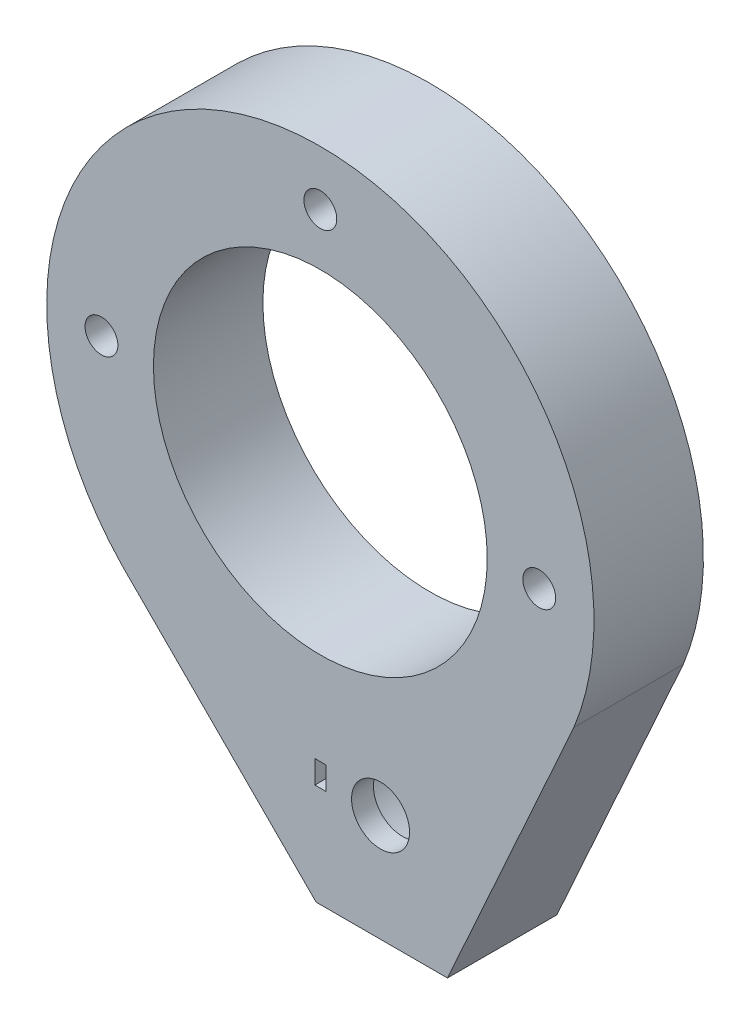
ISO-10303-21;
HEADER;
FILE_DESCRIPTION(('STEP AP214'),'2;1');
FILE_NAME('part.step','',(''),(''),'','','');
FILE_SCHEMA(('AUTOMOTIVE_DESIGN { 1 0 10303 214 1 1 1 1 }'));
ENDSEC;
DATA;
#1=APPLICATION_CONTEXT('core data for automotive mechanical design processes');
#2=APPLICATION_PROTOCOL_DEFINITION('international standard','automotive_design',2000,#1);
#3=PRODUCT_CONTEXT('',#1,'mechanical');
#4=PRODUCT('Part','Part','',(#3));
#5=PRODUCT_RELATED_PRODUCT_CATEGORY('part','',(#4));
#6=PRODUCT_DEFINITION_FORMATION('','',#4);
#7=PRODUCT_DEFINITION_CONTEXT('part definition',#1,'design');
#8=PRODUCT_DEFINITION('design','',#6,#7);
#9=PRODUCT_DEFINITION_SHAPE('','',#8);
#10=(LENGTH_UNIT() NAMED_UNIT(*) SI_UNIT(.MILLI.,.METRE.));
#11=(NAMED_UNIT(*) PLANE_ANGLE_UNIT() SI_UNIT($,.RADIAN.));
#12=(NAMED_UNIT(*) SI_UNIT($,.STERADIAN.) SOLID_ANGLE_UNIT());
#13=UNCERTAINTY_MEASURE_WITH_UNIT(LENGTH_MEASURE(1.E-05),#10,'distance_accuracy_value','');
#14=(GEOMETRIC_REPRESENTATION_CONTEXT(3) GLOBAL_UNCERTAINTY_ASSIGNED_CONTEXT((#13)) GLOBAL_UNIT_ASSIGNED_CONTEXT((#10,
#11,#12)) REPRESENTATION_CONTEXT('',''));
#15=CARTESIAN_POINT('',(0.,0.,0.));
#16=DIRECTION('',(0.,0.,1.));
#17=DIRECTION('',(1.,0.,0.));
#18=AXIS2_PLACEMENT_3D('',#15,#16,#17);
#19=CARTESIAN_POINT('',(20.,0.,-10.));
#20=DIRECTION('',(0.,0.,1.));
#21=DIRECTION('',(-1.,0.,0.));
#22=AXIS2_PLACEMENT_3D('',#19,#20,#21);
#23=CYLINDRICAL_SURFACE('',#22,1.5);
#24=CARTESIAN_POINT('',(20.,0.,0.));
#25=DIRECTION('',(0.,0.,1.));
#26=DIRECTION('',(1.,0.,0.));
#27=AXIS2_PLACEMENT_3D('',#24,#25,#26);
#28=CIRCLE('',#27,1.5);
#29=CARTESIAN_POINT('',(21.5,0.,0.));
#30=VERTEX_POINT('',#29);
#31=EDGE_CURVE('E291',#30,#30,#28,.T.);
#32=ORIENTED_EDGE('',*,*,#31,.T.);
#33=EDGE_LOOP('',(#32));
#34=FACE_BOUND('',#33,.T.);
#35=CARTESIAN_POINT('',(20.,0.,-5.));
#36=DIRECTION('',(0.,0.,1.));
#37=DIRECTION('',(1.,0.,0.));
#38=AXIS2_PLACEMENT_3D('',#35,#36,#37);
#39=CIRCLE('',#38,1.5);
#40=CARTESIAN_POINT('',(21.5,0.,-5.));
#41=VERTEX_POINT('',#40);
#42=EDGE_CURVE('E34',#41,#41,#39,.T.);
#43=ORIENTED_EDGE('',*,*,#42,.F.);
#44=EDGE_LOOP('',(#43));
#45=FACE_BOUND('',#44,.T.);
#46=ADVANCED_FACE('F30',(#34,#45),#23,.F.);
#47=CARTESIAN_POINT('',(0.,20.,-10.));
#48=DIRECTION('',(0.,0.,1.));
#49=DIRECTION('',(-1.,0.,0.));
#50=AXIS2_PLACEMENT_3D('',#47,#48,#49);
#51=CYLINDRICAL_SURFACE('',#50,1.5);
#52=CARTESIAN_POINT('',(0.,20.,0.));
#53=DIRECTION('',(0.,0.,1.));
#54=DIRECTION('',(1.,0.,0.));
#55=AXIS2_PLACEMENT_3D('',#52,#53,#54);
#56=CIRCLE('',#55,1.5);
#57=CARTESIAN_POINT('',(1.5,20.,0.));
#58=VERTEX_POINT('',#57);
#59=EDGE_CURVE('E173',#58,#58,#56,.T.);
#60=ORIENTED_EDGE('',*,*,#59,.T.);
#61=EDGE_LOOP('',(#60));
#62=FACE_BOUND('',#61,.T.);
#63=CARTESIAN_POINT('',(0.,20.,-5.));
#64=DIRECTION('',(0.,0.,1.));
#65=DIRECTION('',(1.,0.,0.));
#66=AXIS2_PLACEMENT_3D('',#63,#64,#65);
#67=CIRCLE('',#66,1.5);
#68=CARTESIAN_POINT('',(1.5,20.,-5.));
#69=VERTEX_POINT('',#68);
#70=EDGE_CURVE('E293',#69,#69,#67,.T.);
#71=ORIENTED_EDGE('',*,*,#70,.F.);
#72=EDGE_LOOP('',(#71));
#73=FACE_BOUND('',#72,.T.);
#74=ADVANCED_FACE('F321',(#62,#73),#51,.F.);
#75=CARTESIAN_POINT('',(-20.,0.,-10.));
#76=DIRECTION('',(0.,0.,1.));
#77=DIRECTION('',(-1.,0.,0.));
#78=AXIS2_PLACEMENT_3D('',#75,#76,#77);
#79=CYLINDRICAL_SURFACE('',#78,1.5);
#80=CARTESIAN_POINT('',(-20.,0.,0.));
#81=DIRECTION('',(0.,0.,1.));
#82=DIRECTION('',(1.,0.,0.));
#83=AXIS2_PLACEMENT_3D('',#80,#81,#82);
#84=CIRCLE('',#83,1.5);
#85=CARTESIAN_POINT('',(-18.5,0.,0.));
#86=VERTEX_POINT('',#85);
#87=EDGE_CURVE('E316',#86,#86,#84,.T.);
#88=ORIENTED_EDGE('',*,*,#87,.T.);
#89=EDGE_LOOP('',(#88));
#90=FACE_BOUND('',#89,.T.);
#91=CARTESIAN_POINT('',(-20.,0.,-5.));
#92=DIRECTION('',(0.,0.,1.));
#93=DIRECTION('',(1.,0.,0.));
#94=AXIS2_PLACEMENT_3D('',#91,#92,#93);
#95=CIRCLE('',#94,1.5);
#96=CARTESIAN_POINT('',(-18.5,0.,-5.));
#97=VERTEX_POINT('',#96);
#98=EDGE_CURVE('E289',#97,#97,#95,.T.);
#99=ORIENTED_EDGE('',*,*,#98,.F.);
#100=EDGE_LOOP('',(#99));
#101=FACE_BOUND('',#100,.T.);
#102=ADVANCED_FACE('F372',(#90,#101),#79,.F.);
#103=CARTESIAN_POINT('',(0.,0.,-10.));
#104=DIRECTION('',(0.,0.,-1.));
#105=DIRECTION('',(1.,0.,0.));
#106=AXIS2_PLACEMENT_3D('',#103,#104,#105);
#107=PLANE('',#106);
#108=CARTESIAN_POINT('',(20.,0.,-10.));
#109=DIRECTION('',(0.,0.,1.));
#110=DIRECTION('',(1.,0.,0.));
#111=AXIS2_PLACEMENT_3D('',#108,#109,#110);
#112=CIRCLE('',#111,3.5);
#113=CARTESIAN_POINT('',(23.5,0.,-10.));
#114=VERTEX_POINT('',#113);
#115=EDGE_CURVE('E309',#114,#114,#112,.T.);
#116=ORIENTED_EDGE('',*,*,#115,.T.);
#117=EDGE_LOOP('',(#116));
#118=FACE_BOUND('',#117,.T.);
#119=CARTESIAN_POINT('',(0.,20.,-10.));
#120=DIRECTION('',(0.,0.,1.));
#121=DIRECTION('',(1.,0.,0.));
#122=AXIS2_PLACEMENT_3D('',#119,#120,#121);
#123=CIRCLE('',#122,3.5);
#124=CARTESIAN_POINT('',(3.5,20.,-10.));
#125=VERTEX_POINT('',#124);
#126=EDGE_CURVE('E302',#125,#125,#123,.T.);
#127=ORIENTED_EDGE('',*,*,#126,.T.);
#128=EDGE_LOOP('',(#127));
#129=FACE_BOUND('',#128,.T.);
#130=CARTESIAN_POINT('',(-20.,0.,-10.));
#131=DIRECTION('',(0.,0.,1.));
#132=DIRECTION('',(1.,0.,0.));
#133=AXIS2_PLACEMENT_3D('',#130,#131,#132);
#134=CIRCLE('',#133,3.5);
#135=CARTESIAN_POINT('',(-16.5,0.,-10.));
#136=VERTEX_POINT('',#135);
#137=EDGE_CURVE('E295',#136,#136,#134,.T.);
#138=ORIENTED_EDGE('',*,*,#137,.T.);
#139=EDGE_LOOP('',(#138));
#140=FACE_BOUND('',#139,.T.);
#141=CARTESIAN_POINT('',(0.,0.,-10.));
#142=DIRECTION('',(0.,0.,1.));
#143=DIRECTION('',(1.,0.,0.));
#144=AXIS2_PLACEMENT_3D('',#141,#142,#143);
#145=CIRCLE('',#144,15.25);
#146=CARTESIAN_POINT('',(15.25,0.,-10.));
#147=VERTEX_POINT('',#146);
#148=EDGE_CURVE('E248',#147,#147,#145,.T.);
#149=ORIENTED_EDGE('',*,*,#148,.T.);
#150=EDGE_LOOP('',(#149));
#151=FACE_BOUND('',#150,.T.);
#152=DIRECTION('',(-0.919751155742739,0.392501989179541,0.));
#153=VECTOR('',#152,1.);
#154=CARTESIAN_POINT('',(-0.272375102761685,-17.6115350120765,-10.));
#155=LINE('',#154,#153);
#156=CARTESIAN_POINT('',(2.59054903818514,-18.8332822348721,-10.));
#157=VERTEX_POINT('',#156);
#158=CARTESIAN_POINT('',(-0.272375102761685,-17.6115350120765,-10.));
#159=VERTEX_POINT('',#158);
#160=EDGE_CURVE('E161',#157,#159,#155,.T.);
#161=ORIENTED_EDGE('',*,*,#160,.T.);
#162=CARTESIAN_POINT('',(-1.44988107030031,-20.3707884793047,-10.));
#163=DIRECTION('',(0.,0.,1.));
#164=DIRECTION('',(1.,0.,0.));
#165=AXIS2_PLACEMENT_3D('',#162,#163,#164);
#166=CIRCLE('',#165,3.);
#167=CARTESIAN_POINT('',(-3.55371741014409,-22.5094498959747,-10.));
#168=VERTEX_POINT('',#167);
#169=EDGE_CURVE('E171',#159,#168,#166,.T.);
#170=ORIENTED_EDGE('',*,*,#169,.T.);
#171=DIRECTION('',(0.712887138889984,-0.701278779947927,0.));
#172=VECTOR('',#171,1.);
#173=CARTESIAN_POINT('',(-3.55371741014409,-22.5094498959747,-10.));
#174=LINE('',#173,#172);
#175=CARTESIAN_POINT('',(-1.47056063690864,-24.5586854070115,-10.));
#176=VERTEX_POINT('',#175);
#177=EDGE_CURVE('E148',#168,#176,#174,.T.);
#178=ORIENTED_EDGE('',*,*,#177,.T.);
#179=CARTESIAN_POINT('',(5.5,-25.2,-10.));
#180=DIRECTION('',(0.,0.,1.));
#181=DIRECTION('',(1.,0.,0.));
#182=AXIS2_PLACEMENT_3D('',#179,#180,#181);
#183=CIRCLE('',#182,7.);
#184=CARTESIAN_POINT('',(4.,-32.0373971655887,-10.));
#185=VERTEX_POINT('',#184);
#186=EDGE_CURVE('E231',#176,#185,#183,.T.);
#187=ORIENTED_EDGE('',*,*,#186,.T.);
#188=DIRECTION('',(0.,-1.,0.));
#189=VECTOR('',#188,1.);
#190=CARTESIAN_POINT('',(4.,-35.,-10.));
#191=LINE('',#190,#189);
#192=CARTESIAN_POINT('',(4.,-35.,-10.));
#193=VERTEX_POINT('',#192);
#194=EDGE_CURVE('E211',#185,#193,#191,.T.);
#195=ORIENTED_EDGE('',*,*,#194,.T.);
#196=DIRECTION('',(1.,0.,0.));
#197=VECTOR('',#196,1.);
#198=CARTESIAN_POINT('',(-0.385076954837017,-35.,-10.));
#199=LINE('',#198,#197);
#200=CARTESIAN_POINT('',(-0.385076954837017,-35.,-10.));
#201=VERTEX_POINT('',#200);
#202=EDGE_CURVE('E257',#201,#193,#199,.T.);
#203=ORIENTED_EDGE('',*,*,#202,.F.);
#204=DIRECTION('',(0.706286331738627,-0.707926279777206,0.));
#205=VECTOR('',#204,1.);
#206=CARTESIAN_POINT('',(-18.121718507486,-17.2221751917532,-10.));
#207=LINE('',#206,#205);
#208=CARTESIAN_POINT('',(-18.121718507486,-17.2221751917532,-10.));
#209=VERTEX_POINT('',#208);
#210=EDGE_CURVE('E252',#209,#201,#207,.T.);
#211=ORIENTED_EDGE('',*,*,#210,.F.);
#212=CARTESIAN_POINT('',(0.,0.,-10.));
#213=DIRECTION('',(0.,0.,1.));
#214=DIRECTION('',(1.,0.,0.));
#215=AXIS2_PLACEMENT_3D('',#212,#213,#214);
#216=CIRCLE('',#215,25.);
#217=CARTESIAN_POINT('',(23.1670303134359,-9.3962070249831,-10.));
#218=VERTEX_POINT('',#217);
#219=EDGE_CURVE('E263',#218,#209,#216,.T.);
#220=ORIENTED_EDGE('',*,*,#219,.F.);
#221=DIRECTION('',(0.411264502619458,0.911516049713426,0.));
#222=VECTOR('',#221,1.);
#223=CARTESIAN_POINT('',(11.614923045163,-35.,-10.));
#224=LINE('',#223,#222);
#225=CARTESIAN_POINT('',(11.614923045163,-35.,-10.));
#226=VERTEX_POINT('',#225);
#227=EDGE_CURVE('E260',#226,#218,#224,.T.);
#228=ORIENTED_EDGE('',*,*,#227,.F.);
#229=CARTESIAN_POINT('',(7.,-35.,-10.));
#230=VERTEX_POINT('',#229);
#231=EDGE_CURVE('E255',#230,#226,#199,.T.);
#232=ORIENTED_EDGE('',*,*,#231,.F.);
#233=DIRECTION('',(0.,1.,0.));
#234=VECTOR('',#233,1.);
#235=CARTESIAN_POINT('',(7.,-35.,-10.));
#236=LINE('',#235,#234);
#237=CARTESIAN_POINT('',(7.,-32.0373971655887,-10.));
#238=VERTEX_POINT('',#237);
#239=EDGE_CURVE('E219',#230,#238,#236,.T.);
#240=ORIENTED_EDGE('',*,*,#239,.T.);
#241=EDGE_CURVE('E241',#238,#157,#183,.T.);
#242=ORIENTED_EDGE('',*,*,#241,.T.);
#243=EDGE_LOOP('',(#161,#170,#178,#187,#195,#203,#211,#220,#228,#232,#240,#242));
#244=FACE_BOUND('',#243,.T.);
#245=ADVANCED_FACE('F328',(#118,#129,#140,#151,#244),#107,.T.);
#246=CARTESIAN_POINT('',(0.,0.,0.));
#247=DIRECTION('',(0.,0.,-1.));
#248=DIRECTION('',(1.,0.,0.));
#249=AXIS2_PLACEMENT_3D('',#246,#247,#248);
#250=PLANE('',#249);
#251=ORIENTED_EDGE('',*,*,#87,.F.);
#252=EDGE_LOOP('',(#251));
#253=FACE_BOUND('',#252,.T.);
#254=DIRECTION('',(0.706286331738627,-0.707926279777206,0.));
#255=VECTOR('',#254,1.);
#256=CARTESIAN_POINT('',(-18.121718507486,-17.2221751917532,0.));
#257=LINE('',#256,#255);
#258=CARTESIAN_POINT('',(-18.121718507486,-17.2221751917532,0.));
#259=VERTEX_POINT('',#258);
#260=CARTESIAN_POINT('',(-0.385076954837017,-35.,0.));
#261=VERTEX_POINT('',#260);
#262=EDGE_CURVE('E247',#259,#261,#257,.T.);
#263=ORIENTED_EDGE('',*,*,#262,.T.);
#264=DIRECTION('',(1.,0.,0.));
#265=VECTOR('',#264,1.);
#266=CARTESIAN_POINT('',(-0.385076954837017,-35.,0.));
#267=LINE('',#266,#265);
#268=CARTESIAN_POINT('',(11.614923045163,-35.,0.));
#269=VERTEX_POINT('',#268);
#270=EDGE_CURVE('E269',#261,#269,#267,.T.);
#271=ORIENTED_EDGE('',*,*,#270,.T.);
#272=DIRECTION('',(0.411264502619458,0.911516049713426,0.));
#273=VECTOR('',#272,1.);
#274=CARTESIAN_POINT('',(11.614923045163,-35.,0.));
#275=LINE('',#274,#273);
#276=CARTESIAN_POINT('',(23.1670303134359,-9.3962070249831,0.));
#277=VERTEX_POINT('',#276);
#278=EDGE_CURVE('E272',#269,#277,#275,.T.);
#279=ORIENTED_EDGE('',*,*,#278,.T.);
#280=CARTESIAN_POINT('',(0.,0.,0.));
#281=DIRECTION('',(0.,0.,1.));
#282=DIRECTION('',(1.,0.,0.));
#283=AXIS2_PLACEMENT_3D('',#280,#281,#282);
#284=CIRCLE('',#283,25.);
#285=EDGE_CURVE('E256',#277,#259,#284,.T.);
#286=ORIENTED_EDGE('',*,*,#285,.T.);
#287=EDGE_LOOP('',(#263,#271,#279,#286));
#288=FACE_BOUND('',#287,.T.);
#289=CARTESIAN_POINT('',(0.,0.,0.));
#290=DIRECTION('',(0.,0.,1.));
#291=DIRECTION('',(1.,0.,0.));
#292=AXIS2_PLACEMENT_3D('',#289,#290,#291);
#293=CIRCLE('',#292,15.25);
#294=CARTESIAN_POINT('',(15.25,0.,0.));
#295=VERTEX_POINT('',#294);
#296=EDGE_CURVE('E244',#295,#295,#293,.T.);
#297=ORIENTED_EDGE('',*,*,#296,.F.);
#298=EDGE_LOOP('',(#297));
#299=FACE_BOUND('',#298,.T.);
#300=CARTESIAN_POINT('',(5.5,-25.2,0.));
#301=DIRECTION('',(0.,0.,1.));
#302=DIRECTION('',(1.,0.,0.));
#303=AXIS2_PLACEMENT_3D('',#300,#301,#302);
#304=CIRCLE('',#303,2.65);
#305=CARTESIAN_POINT('',(8.15,-25.2,0.));
#306=VERTEX_POINT('',#305);
#307=EDGE_CURVE('E251',#306,#306,#304,.T.);
#308=ORIENTED_EDGE('',*,*,#307,.F.);
#309=EDGE_LOOP('',(#308));
#310=FACE_BOUND('',#309,.T.);
#311=DIRECTION('',(1.,0.,0.));
#312=VECTOR('',#311,1.);
#313=CARTESIAN_POINT('',(0.5,-25.7910088137421,0.));
#314=LINE('',#313,#312);
#315=CARTESIAN_POINT('',(-0.5,-25.7910088137421,0.));
#316=VERTEX_POINT('',#315);
#317=CARTESIAN_POINT('',(0.5,-25.7910088137421,0.));
#318=VERTEX_POINT('',#317);
#319=EDGE_CURVE('E195',#316,#318,#314,.T.);
#320=ORIENTED_EDGE('',*,*,#319,.F.);
#321=DIRECTION('',(0.,-1.,0.));
#322=VECTOR('',#321,1.);
#323=CARTESIAN_POINT('',(-0.500000000000001,-23.6910088137421,0.));
#324=LINE('',#323,#322);
#325=CARTESIAN_POINT('',(-0.500000000000001,-23.6910088137421,0.));
#326=VERTEX_POINT('',#325);
#327=EDGE_CURVE('E193',#326,#316,#324,.T.);
#328=ORIENTED_EDGE('',*,*,#327,.F.);
#329=DIRECTION('',(-1.,0.,0.));
#330=VECTOR('',#329,1.);
#331=CARTESIAN_POINT('',(0.499999999999999,-23.6910088137421,0.));
#332=LINE('',#331,#330);
#333=CARTESIAN_POINT('',(0.499999999999999,-23.6910088137421,0.));
#334=VERTEX_POINT('',#333);
#335=EDGE_CURVE('E190',#334,#326,#332,.T.);
#336=ORIENTED_EDGE('',*,*,#335,.F.);
#337=DIRECTION('',(0.,1.,0.));
#338=VECTOR('',#337,1.);
#339=CARTESIAN_POINT('',(0.499999999999999,-23.6910088137421,0.));
#340=LINE('',#339,#338);
#341=EDGE_CURVE('E187',#318,#334,#340,.T.);
#342=ORIENTED_EDGE('',*,*,#341,.F.);
#343=EDGE_LOOP('',(#320,#328,#336,#342));
#344=FACE_BOUND('',#343,.T.);
#345=ORIENTED_EDGE('',*,*,#59,.F.);
#346=EDGE_LOOP('',(#345));
#347=FACE_BOUND('',#346,.T.);
#348=ORIENTED_EDGE('',*,*,#31,.F.);
#349=EDGE_LOOP('',(#348));
#350=FACE_BOUND('',#349,.T.);
#351=ADVANCED_FACE('F324',(#253,#288,#299,#310,#344,#347,#350),#250,.F.);
#352=CARTESIAN_POINT('',(5.5,-25.2,-10.));
#353=DIRECTION('',(0.,0.,-1.));
#354=DIRECTION('',(1.,0.,0.));
#355=AXIS2_PLACEMENT_3D('',#352,#353,#354);
#356=CYLINDRICAL_SURFACE('',#355,2.65);
#357=ORIENTED_EDGE('',*,*,#307,.T.);
#358=EDGE_LOOP('',(#357));
#359=FACE_BOUND('',#358,.T.);
#360=CARTESIAN_POINT('',(5.5,-25.2,-2.));
#361=DIRECTION('',(0.,0.,1.));
#362=DIRECTION('',(1.,0.,0.));
#363=AXIS2_PLACEMENT_3D('',#360,#361,#362);
#364=CIRCLE('',#363,2.65);
#365=CARTESIAN_POINT('',(8.15,-25.2,-2.));
#366=VERTEX_POINT('',#365);
#367=EDGE_CURVE('E240',#366,#366,#364,.F.);
#368=ORIENTED_EDGE('',*,*,#367,.T.);
#369=EDGE_LOOP('',(#368));
#370=FACE_BOUND('',#369,.T.);
#371=ADVANCED_FACE('F327',(#359,#370),#356,.F.);
#372=CARTESIAN_POINT('',(-18.121718507486,-17.2221751917532,-10.));
#373=DIRECTION('',(0.707926279777206,0.706286331738627,0.));
#374=DIRECTION('',(-0.706286331738627,0.707926279777206,0.));
#375=AXIS2_PLACEMENT_3D('',#372,#373,#374);
#376=PLANE('',#375);
#377=ORIENTED_EDGE('',*,*,#262,.F.);
#378=DIRECTION('',(0.,0.,1.));
#379=VECTOR('',#378,1.);
#380=CARTESIAN_POINT('',(-18.121718507486,-17.2221751917532,-10.));
#381=LINE('',#380,#379);
#382=EDGE_CURVE('E266',#209,#259,#381,.T.);
#383=ORIENTED_EDGE('',*,*,#382,.F.);
#384=ORIENTED_EDGE('',*,*,#210,.T.);
#385=DIRECTION('',(0.,0.,1.));
#386=VECTOR('',#385,1.);
#387=CARTESIAN_POINT('',(-0.385076954837017,-35.,-10.));
#388=LINE('',#387,#386);
#389=EDGE_CURVE('E39',#201,#261,#388,.T.);
#390=ORIENTED_EDGE('',*,*,#389,.T.);
#391=EDGE_LOOP('',(#377,#383,#384,#390));
#392=FACE_BOUND('',#391,.T.);
#393=ADVANCED_FACE('F32',(#392),#376,.F.);
#394=CARTESIAN_POINT('',(-0.385076954837017,-35.,-10.));
#395=DIRECTION('',(0.,1.,0.));
#396=DIRECTION('',(0.,0.,-1.));
#397=AXIS2_PLACEMENT_3D('',#394,#395,#396);
#398=PLANE('',#397);
#399=DIRECTION('',(1.,0.,0.));
#400=VECTOR('',#399,1.);
#401=CARTESIAN_POINT('',(4.,-35.,-7.));
#402=LINE('',#401,#400);
#403=CARTESIAN_POINT('',(4.,-35.,-7.));
#404=VERTEX_POINT('',#403);
#405=CARTESIAN_POINT('',(7.,-35.,-7.));
#406=VERTEX_POINT('',#405);
#407=EDGE_CURVE('E218',#404,#406,#402,.T.);
#408=ORIENTED_EDGE('',*,*,#407,.T.);
#409=DIRECTION('',(0.,0.,-1.));
#410=VECTOR('',#409,1.);
#411=CARTESIAN_POINT('',(7.,-35.,-7.));
#412=LINE('',#411,#410);
#413=EDGE_CURVE('E234',#406,#230,#412,.T.);
#414=ORIENTED_EDGE('',*,*,#413,.T.);
#415=ORIENTED_EDGE('',*,*,#231,.T.);
#416=DIRECTION('',(0.,0.,1.));
#417=VECTOR('',#416,1.);
#418=CARTESIAN_POINT('',(11.614923045163,-35.,-10.));
#419=LINE('',#418,#417);
#420=EDGE_CURVE('E280',#226,#269,#419,.T.);
#421=ORIENTED_EDGE('',*,*,#420,.T.);
#422=ORIENTED_EDGE('',*,*,#270,.F.);
#423=ORIENTED_EDGE('',*,*,#389,.F.);
#424=ORIENTED_EDGE('',*,*,#202,.T.);
#425=DIRECTION('',(0.,0.,-1.));
#426=VECTOR('',#425,1.);
#427=CARTESIAN_POINT('',(4.,-35.,-7.));
#428=LINE('',#427,#426);
#429=EDGE_CURVE('E224',#404,#193,#428,.T.);
#430=ORIENTED_EDGE('',*,*,#429,.F.);
#431=EDGE_LOOP('',(#408,#414,#415,#421,#422,#423,#424,#430));
#432=FACE_BOUND('',#431,.T.);
#433=ADVANCED_FACE('F446',(#432),#398,.F.);
#434=CARTESIAN_POINT('',(11.614923045163,-35.,-10.));
#435=DIRECTION('',(-0.911516049713426,0.411264502619458,0.));
#436=DIRECTION('',(-0.411264502619458,-0.911516049713427,0.));
#437=AXIS2_PLACEMENT_3D('',#434,#435,#436);
#438=PLANE('',#437);
#439=ORIENTED_EDGE('',*,*,#278,.F.);
#440=ORIENTED_EDGE('',*,*,#420,.F.);
#441=ORIENTED_EDGE('',*,*,#227,.T.);
#442=DIRECTION('',(0.,0.,1.));
#443=VECTOR('',#442,1.);
#444=CARTESIAN_POINT('',(23.1670303134359,-9.3962070249831,-10.));
#445=LINE('',#444,#443);
#446=EDGE_CURVE('E278',#218,#277,#445,.T.);
#447=ORIENTED_EDGE('',*,*,#446,.T.);
#448=EDGE_LOOP('',(#439,#440,#441,#447));
#449=FACE_BOUND('',#448,.T.);
#450=ADVANCED_FACE('F443',(#449),#438,.F.);
#451=CARTESIAN_POINT('',(0.,0.,-10.));
#452=DIRECTION('',(0.,0.,1.));
#453=DIRECTION('',(-1.,0.,0.));
#454=AXIS2_PLACEMENT_3D('',#451,#452,#453);
#455=CYLINDRICAL_SURFACE('',#454,25.);
#456=ORIENTED_EDGE('',*,*,#285,.F.);
#457=ORIENTED_EDGE('',*,*,#446,.F.);
#458=ORIENTED_EDGE('',*,*,#219,.T.);
#459=ORIENTED_EDGE('',*,*,#382,.T.);
#460=EDGE_LOOP('',(#456,#457,#458,#459));
#461=FACE_BOUND('',#460,.T.);
#462=ADVANCED_FACE('F437',(#461),#455,.T.);
#463=CARTESIAN_POINT('',(0.,0.,0.));
#464=DIRECTION('',(0.,0.,-1.));
#465=DIRECTION('',(1.,0.,0.));
#466=AXIS2_PLACEMENT_3D('',#463,#464,#465);
#467=CYLINDRICAL_SURFACE('',#466,15.25);
#468=ORIENTED_EDGE('',*,*,#296,.T.);
#469=EDGE_LOOP('',(#468));
#470=FACE_BOUND('',#469,.T.);
#471=ORIENTED_EDGE('',*,*,#148,.F.);
#472=EDGE_LOOP('',(#471));
#473=FACE_BOUND('',#472,.T.);
#474=ADVANCED_FACE('F427',(#470,#473),#467,.F.);
#475=CARTESIAN_POINT('',(5.5,-25.2,-2.));
#476=DIRECTION('',(0.,0.,-1.));
#477=DIRECTION('',(1.,0.,0.));
#478=AXIS2_PLACEMENT_3D('',#475,#476,#477);
#479=PLANE('',#478);
#480=DIRECTION('',(0.,1.,0.));
#481=VECTOR('',#480,1.);
#482=CARTESIAN_POINT('',(0.499999999999999,-23.6910088137421,-2.));
#483=LINE('',#482,#481);
#484=CARTESIAN_POINT('',(0.5,-25.7910088137421,-2.));
#485=VERTEX_POINT('',#484);
#486=CARTESIAN_POINT('',(0.5,-23.6910088137421,-2.));
#487=VERTEX_POINT('',#486);
#488=EDGE_CURVE('E186',#485,#487,#483,.T.);
#489=ORIENTED_EDGE('',*,*,#488,.T.);
#490=DIRECTION('',(-1.,0.,0.));
#491=VECTOR('',#490,1.);
#492=CARTESIAN_POINT('',(0.499999999999999,-23.6910088137421,-2.));
#493=LINE('',#492,#491);
#494=CARTESIAN_POINT('',(-0.500000000000001,-23.6910088137421,-2.));
#495=VERTEX_POINT('',#494);
#496=EDGE_CURVE('E201',#487,#495,#493,.T.);
#497=ORIENTED_EDGE('',*,*,#496,.T.);
#498=DIRECTION('',(0.,-1.,0.));
#499=VECTOR('',#498,1.);
#500=CARTESIAN_POINT('',(-0.500000000000001,-23.6910088137421,-2.));
#501=LINE('',#500,#499);
#502=CARTESIAN_POINT('',(-0.5,-25.7910088137421,-2.));
#503=VERTEX_POINT('',#502);
#504=EDGE_CURVE('E204',#495,#503,#501,.T.);
#505=ORIENTED_EDGE('',*,*,#504,.T.);
#506=DIRECTION('',(1.,0.,0.));
#507=VECTOR('',#506,1.);
#508=CARTESIAN_POINT('',(0.5,-25.7910088137421,-2.));
#509=LINE('',#508,#507);
#510=EDGE_CURVE('E191',#503,#485,#509,.T.);
#511=ORIENTED_EDGE('',*,*,#510,.T.);
#512=EDGE_LOOP('',(#489,#497,#505,#511));
#513=FACE_BOUND('',#512,.T.);
#514=CARTESIAN_POINT('',(5.5,-25.2,-2.));
#515=DIRECTION('',(0.,0.,1.));
#516=DIRECTION('',(1.,0.,0.));
#517=AXIS2_PLACEMENT_3D('',#514,#515,#516);
#518=CIRCLE('',#517,7.);
#519=CARTESIAN_POINT('',(12.5,-25.2,-2.));
#520=VERTEX_POINT('',#519);
#521=EDGE_CURVE('E237',#520,#520,#518,.T.);
#522=ORIENTED_EDGE('',*,*,#521,.F.);
#523=EDGE_LOOP('',(#522));
#524=FACE_BOUND('',#523,.T.);
#525=ORIENTED_EDGE('',*,*,#367,.F.);
#526=EDGE_LOOP('',(#525));
#527=FACE_BOUND('',#526,.T.);
#528=ADVANCED_FACE('F424',(#513,#524,#527),#479,.T.);
#529=CARTESIAN_POINT('',(5.5,-25.2,-2.));
#530=DIRECTION('',(0.,0.,-1.));
#531=DIRECTION('',(1.,0.,0.));
#532=AXIS2_PLACEMENT_3D('',#529,#530,#531);
#533=CYLINDRICAL_SURFACE('',#532,7.);
#534=ORIENTED_EDGE('',*,*,#241,.F.);
#535=DIRECTION('',(0.,0.,-1.));
#536=VECTOR('',#535,1.);
#537=CARTESIAN_POINT('',(7.,-32.0373971655887,-7.));
#538=LINE('',#537,#536);
#539=CARTESIAN_POINT('',(7.,-32.0373971655887,-7.));
#540=VERTEX_POINT('',#539);
#541=EDGE_CURVE('E232',#540,#238,#538,.T.);
#542=ORIENTED_EDGE('',*,*,#541,.F.);
#543=CARTESIAN_POINT('',(5.5,-25.2,-7.));
#544=DIRECTION('',(0.,0.,-1.));
#545=DIRECTION('',(-1.,0.,0.));
#546=AXIS2_PLACEMENT_3D('',#543,#544,#545);
#547=CIRCLE('',#546,7.);
#548=CARTESIAN_POINT('',(4.,-32.0373971655887,-7.));
#549=VERTEX_POINT('',#548);
#550=EDGE_CURVE('E11',#549,#540,#547,.F.);
#551=ORIENTED_EDGE('',*,*,#550,.F.);
#552=DIRECTION('',(0.,0.,-1.));
#553=VECTOR('',#552,1.);
#554=CARTESIAN_POINT('',(4.,-32.0373971655887,-7.));
#555=LINE('',#554,#553);
#556=EDGE_CURVE('E229',#549,#185,#555,.T.);
#557=ORIENTED_EDGE('',*,*,#556,.T.);
#558=ORIENTED_EDGE('',*,*,#186,.F.);
#559=DIRECTION('',(0.,0.,-1.));
#560=VECTOR('',#559,1.);
#561=CARTESIAN_POINT('',(-1.47056063690864,-24.5586854070115,-8.));
#562=LINE('',#561,#560);
#563=CARTESIAN_POINT('',(-1.47056063690863,-24.5586854070115,-8.));
#564=VERTEX_POINT('',#563);
#565=EDGE_CURVE('E152',#564,#176,#562,.T.);
#566=ORIENTED_EDGE('',*,*,#565,.F.);
#567=CARTESIAN_POINT('',(5.5,-25.2,-8.));
#568=DIRECTION('',(0.,0.,1.));
#569=DIRECTION('',(1.,0.,0.));
#570=AXIS2_PLACEMENT_3D('',#567,#568,#569);
#571=CIRCLE('',#570,7.);
#572=CARTESIAN_POINT('',(2.59054903818514,-18.8332822348721,-8.));
#573=VERTEX_POINT('',#572);
#574=EDGE_CURVE('E165',#564,#573,#571,.F.);
#575=ORIENTED_EDGE('',*,*,#574,.T.);
#576=DIRECTION('',(0.,0.,-1.));
#577=VECTOR('',#576,1.);
#578=CARTESIAN_POINT('',(2.59054903818514,-18.8332822348721,-8.));
#579=LINE('',#578,#577);
#580=EDGE_CURVE('E179',#573,#157,#579,.T.);
#581=ORIENTED_EDGE('',*,*,#580,.T.);
#582=EDGE_LOOP('',(#534,#542,#551,#557,#558,#566,#575,#581));
#583=FACE_BOUND('',#582,.T.);
#584=ORIENTED_EDGE('',*,*,#521,.T.);
#585=EDGE_LOOP('',(#584));
#586=FACE_BOUND('',#585,.T.);
#587=ADVANCED_FACE('F416',(#583,#586),#533,.F.);
#588=CARTESIAN_POINT('',(4.,-32.0373971655887,-7.));
#589=DIRECTION('',(0.,0.,1.));
#590=DIRECTION('',(-1.,0.,0.));
#591=AXIS2_PLACEMENT_3D('',#588,#589,#590);
#592=PLANE('',#591);
#593=DIRECTION('',(0.,-1.,0.));
#594=VECTOR('',#593,1.);
#595=CARTESIAN_POINT('',(4.,-35.,-7.));
#596=LINE('',#595,#594);
#597=EDGE_CURVE('E216',#549,#404,#596,.T.);
#598=ORIENTED_EDGE('',*,*,#597,.F.);
#599=ORIENTED_EDGE('',*,*,#550,.T.);
#600=DIRECTION('',(0.,1.,0.));
#601=VECTOR('',#600,1.);
#602=CARTESIAN_POINT('',(7.,-35.,-7.));
#603=LINE('',#602,#601);
#604=EDGE_CURVE('E222',#406,#540,#603,.T.);
#605=ORIENTED_EDGE('',*,*,#604,.F.);
#606=ORIENTED_EDGE('',*,*,#407,.F.);
#607=EDGE_LOOP('',(#598,#599,#605,#606));
#608=FACE_BOUND('',#607,.T.);
#609=ADVANCED_FACE('F412',(#608),#592,.F.);
#610=CARTESIAN_POINT('',(4.,-35.,-7.));
#611=DIRECTION('',(-1.,0.,0.));
#612=DIRECTION('',(0.,0.,-1.));
#613=AXIS2_PLACEMENT_3D('',#610,#611,#612);
#614=PLANE('',#613);
#615=ORIENTED_EDGE('',*,*,#194,.F.);
#616=ORIENTED_EDGE('',*,*,#556,.F.);
#617=ORIENTED_EDGE('',*,*,#597,.T.);
#618=ORIENTED_EDGE('',*,*,#429,.T.);
#619=EDGE_LOOP('',(#615,#616,#617,#618));
#620=FACE_BOUND('',#619,.T.);
#621=ADVANCED_FACE('F415',(#620),#614,.F.);
#622=CARTESIAN_POINT('',(7.,-35.,-7.));
#623=DIRECTION('',(1.,0.,0.));
#624=DIRECTION('',(0.,0.,1.));
#625=AXIS2_PLACEMENT_3D('',#622,#623,#624);
#626=PLANE('',#625);
#627=ORIENTED_EDGE('',*,*,#239,.F.);
#628=ORIENTED_EDGE('',*,*,#413,.F.);
#629=ORIENTED_EDGE('',*,*,#604,.T.);
#630=ORIENTED_EDGE('',*,*,#541,.T.);
#631=EDGE_LOOP('',(#627,#628,#629,#630));
#632=FACE_BOUND('',#631,.T.);
#633=ADVANCED_FACE('F410',(#632),#626,.F.);
#634=CARTESIAN_POINT('',(0.499999999999999,-23.6910088137421,0.));
#635=DIRECTION('',(1.,0.,0.));
#636=DIRECTION('',(0.,1.,0.));
#637=AXIS2_PLACEMENT_3D('',#634,#635,#636);
#638=PLANE('',#637);
#639=ORIENTED_EDGE('',*,*,#488,.F.);
#640=DIRECTION('',(0.,0.,-1.));
#641=VECTOR('',#640,1.);
#642=CARTESIAN_POINT('',(0.5,-25.7910088137421,0.));
#643=LINE('',#642,#641);
#644=EDGE_CURVE('E209',#318,#485,#643,.T.);
#645=ORIENTED_EDGE('',*,*,#644,.F.);
#646=ORIENTED_EDGE('',*,*,#341,.T.);
#647=DIRECTION('',(0.,0.,-1.));
#648=VECTOR('',#647,1.);
#649=CARTESIAN_POINT('',(0.499999999999999,-23.6910088137421,0.));
#650=LINE('',#649,#648);
#651=EDGE_CURVE('E198',#334,#487,#650,.T.);
#652=ORIENTED_EDGE('',*,*,#651,.T.);
#653=EDGE_LOOP('',(#639,#645,#646,#652));
#654=FACE_BOUND('',#653,.T.);
#655=ADVANCED_FACE('F401',(#654),#638,.F.);
#656=CARTESIAN_POINT('',(0.5,-25.7910088137421,0.));
#657=DIRECTION('',(0.,-1.,0.));
#658=DIRECTION('',(0.,0.,1.));
#659=AXIS2_PLACEMENT_3D('',#656,#657,#658);
#660=PLANE('',#659);
#661=ORIENTED_EDGE('',*,*,#510,.F.);
#662=DIRECTION('',(0.,0.,-1.));
#663=VECTOR('',#662,1.);
#664=CARTESIAN_POINT('',(-0.5,-25.7910088137421,0.));
#665=LINE('',#664,#663);
#666=EDGE_CURVE('E212',#316,#503,#665,.T.);
#667=ORIENTED_EDGE('',*,*,#666,.F.);
#668=ORIENTED_EDGE('',*,*,#319,.T.);
#669=ORIENTED_EDGE('',*,*,#644,.T.);
#670=EDGE_LOOP('',(#661,#667,#668,#669));
#671=FACE_BOUND('',#670,.T.);
#672=ADVANCED_FACE('F397',(#671),#660,.F.);
#673=CARTESIAN_POINT('',(-0.500000000000001,-23.6910088137421,0.));
#674=DIRECTION('',(-1.,0.,0.));
#675=DIRECTION('',(0.,-1.,0.));
#676=AXIS2_PLACEMENT_3D('',#673,#674,#675);
#677=PLANE('',#676);
#678=ORIENTED_EDGE('',*,*,#504,.F.);
#679=DIRECTION('',(0.,0.,-1.));
#680=VECTOR('',#679,1.);
#681=CARTESIAN_POINT('',(-0.500000000000001,-23.6910088137421,0.));
#682=LINE('',#681,#680);
#683=EDGE_CURVE('E55',#326,#495,#682,.T.);
#684=ORIENTED_EDGE('',*,*,#683,.F.);
#685=ORIENTED_EDGE('',*,*,#327,.T.);
#686=ORIENTED_EDGE('',*,*,#666,.T.);
#687=EDGE_LOOP('',(#678,#684,#685,#686));
#688=FACE_BOUND('',#687,.T.);
#689=ADVANCED_FACE('F400',(#688),#677,.F.);
#690=CARTESIAN_POINT('',(0.499999999999999,-23.6910088137421,0.));
#691=DIRECTION('',(0.,1.,0.));
#692=DIRECTION('',(0.,0.,-1.));
#693=AXIS2_PLACEMENT_3D('',#690,#691,#692);
#694=PLANE('',#693);
#695=ORIENTED_EDGE('',*,*,#496,.F.);
#696=ORIENTED_EDGE('',*,*,#651,.F.);
#697=ORIENTED_EDGE('',*,*,#335,.T.);
#698=ORIENTED_EDGE('',*,*,#683,.T.);
#699=EDGE_LOOP('',(#695,#696,#697,#698));
#700=FACE_BOUND('',#699,.T.);
#701=ADVANCED_FACE('F380',(#700),#694,.F.);
#702=CARTESIAN_POINT('',(-1.44988107030031,-20.3707884793047,-8.));
#703=DIRECTION('',(0.,0.,-1.));
#704=DIRECTION('',(1.,0.,0.));
#705=AXIS2_PLACEMENT_3D('',#702,#703,#704);
#706=PLANE('',#705);
#707=CARTESIAN_POINT('',(-1.44988107030031,-20.3707884793047,-8.));
#708=DIRECTION('',(0.,0.,1.));
#709=DIRECTION('',(1.,0.,0.));
#710=AXIS2_PLACEMENT_3D('',#707,#708,#709);
#711=CIRCLE('',#710,0.900000000000001);
#712=CARTESIAN_POINT('',(-0.549881070300307,-20.3707884793047,-8.));
#713=VERTEX_POINT('',#712);
#714=EDGE_CURVE('E178',#713,#713,#711,.F.);
#715=ORIENTED_EDGE('',*,*,#714,.F.);
#716=EDGE_LOOP('',(#715));
#717=FACE_BOUND('',#716,.T.);
#718=ORIENTED_EDGE('',*,*,#574,.F.);
#719=DIRECTION('',(0.712887138889984,-0.701278779947927,0.));
#720=VECTOR('',#719,1.);
#721=CARTESIAN_POINT('',(-3.55371741014409,-22.5094498959747,-8.));
#722=LINE('',#721,#720);
#723=CARTESIAN_POINT('',(-3.55371741014409,-22.5094498959747,-8.));
#724=VERTEX_POINT('',#723);
#725=EDGE_CURVE('E47',#724,#564,#722,.T.);
#726=ORIENTED_EDGE('',*,*,#725,.F.);
#727=CARTESIAN_POINT('',(-1.44988107030031,-20.3707884793047,-8.));
#728=DIRECTION('',(0.,0.,1.));
#729=DIRECTION('',(1.,0.,0.));
#730=AXIS2_PLACEMENT_3D('',#727,#728,#729);
#731=CIRCLE('',#730,3.);
#732=CARTESIAN_POINT('',(-0.272375102761685,-17.6115350120765,-8.));
#733=VERTEX_POINT('',#732);
#734=EDGE_CURVE('E156',#733,#724,#731,.T.);
#735=ORIENTED_EDGE('',*,*,#734,.F.);
#736=DIRECTION('',(-0.919751155742739,0.392501989179541,0.));
#737=VECTOR('',#736,1.);
#738=CARTESIAN_POINT('',(-0.272375102761685,-17.6115350120765,-8.));
#739=LINE('',#738,#737);
#740=EDGE_CURVE('E153',#573,#733,#739,.T.);
#741=ORIENTED_EDGE('',*,*,#740,.F.);
#742=EDGE_LOOP('',(#718,#726,#735,#741));
#743=FACE_BOUND('',#742,.T.);
#744=ADVANCED_FACE('F163',(#717,#743),#706,.T.);
#745=CARTESIAN_POINT('',(-1.44988107030031,-20.3707884793047,-8.));
#746=DIRECTION('',(0.,0.,-1.));
#747=DIRECTION('',(1.,0.,0.));
#748=AXIS2_PLACEMENT_3D('',#745,#746,#747);
#749=CYLINDRICAL_SURFACE('',#748,3.);
#750=ORIENTED_EDGE('',*,*,#169,.F.);
#751=DIRECTION('',(0.,0.,-1.));
#752=VECTOR('',#751,1.);
#753=CARTESIAN_POINT('',(-0.272375102761685,-17.6115350120765,-8.));
#754=LINE('',#753,#752);
#755=EDGE_CURVE('E158',#733,#159,#754,.T.);
#756=ORIENTED_EDGE('',*,*,#755,.F.);
#757=ORIENTED_EDGE('',*,*,#734,.T.);
#758=DIRECTION('',(0.,0.,-1.));
#759=VECTOR('',#758,1.);
#760=CARTESIAN_POINT('',(-3.55371741014409,-22.5094498959747,-8.));
#761=LINE('',#760,#759);
#762=EDGE_CURVE('E144',#724,#168,#761,.T.);
#763=ORIENTED_EDGE('',*,*,#762,.T.);
#764=EDGE_LOOP('',(#750,#756,#757,#763));
#765=FACE_BOUND('',#764,.T.);
#766=ADVANCED_FACE('F157',(#765),#749,.F.);
#767=CARTESIAN_POINT('',(-0.272375102761685,-17.6115350120765,-8.));
#768=DIRECTION('',(0.392501989179541,0.919751155742739,0.));
#769=DIRECTION('',(-0.919751155742739,0.392501989179541,0.));
#770=AXIS2_PLACEMENT_3D('',#767,#768,#769);
#771=PLANE('',#770);
#772=ORIENTED_EDGE('',*,*,#160,.F.);
#773=ORIENTED_EDGE('',*,*,#580,.F.);
#774=ORIENTED_EDGE('',*,*,#740,.T.);
#775=ORIENTED_EDGE('',*,*,#755,.T.);
#776=EDGE_LOOP('',(#772,#773,#774,#775));
#777=FACE_BOUND('',#776,.T.);
#778=ADVANCED_FACE('F382',(#777),#771,.F.);
#779=CARTESIAN_POINT('',(-3.55371741014409,-22.5094498959747,-8.));
#780=DIRECTION('',(-0.701278779947927,-0.712887138889984,0.));
#781=DIRECTION('',(0.712887138889984,-0.701278779947927,0.));
#782=AXIS2_PLACEMENT_3D('',#779,#780,#781);
#783=PLANE('',#782);
#784=ORIENTED_EDGE('',*,*,#177,.F.);
#785=ORIENTED_EDGE('',*,*,#762,.F.);
#786=ORIENTED_EDGE('',*,*,#725,.T.);
#787=ORIENTED_EDGE('',*,*,#565,.T.);
#788=EDGE_LOOP('',(#784,#785,#786,#787));
#789=FACE_BOUND('',#788,.T.);
#790=ADVANCED_FACE('F146',(#789),#783,.F.);
#791=CARTESIAN_POINT('',(-1.44988107030031,-20.3707884793047,-5.));
#792=DIRECTION('',(0.,0.,-1.));
#793=DIRECTION('',(1.,0.,0.));
#794=AXIS2_PLACEMENT_3D('',#791,#792,#793);
#795=PLANE('',#794);
#796=CARTESIAN_POINT('',(-1.44988107030031,-20.3707884793047,-5.));
#797=DIRECTION('',(0.,0.,1.));
#798=DIRECTION('',(1.,0.,0.));
#799=AXIS2_PLACEMENT_3D('',#796,#797,#798);
#800=CIRCLE('',#799,0.900000000000001);
#801=CARTESIAN_POINT('',(-0.549881070300307,-20.3707884793047,-5.));
#802=VERTEX_POINT('',#801);
#803=EDGE_CURVE('E183',#802,#802,#800,.T.);
#804=ORIENTED_EDGE('',*,*,#803,.F.);
#805=EDGE_LOOP('',(#804));
#806=FACE_BOUND('',#805,.T.);
#807=ADVANCED_FACE('F388',(#806),#795,.T.);
#808=CARTESIAN_POINT('',(-1.44988107030031,-20.3707884793047,-5.));
#809=DIRECTION('',(0.,0.,-1.));
#810=DIRECTION('',(1.,0.,0.));
#811=AXIS2_PLACEMENT_3D('',#808,#809,#810);
#812=CYLINDRICAL_SURFACE('',#811,0.900000000000001);
#813=ORIENTED_EDGE('',*,*,#803,.T.);
#814=EDGE_LOOP('',(#813));
#815=FACE_BOUND('',#814,.T.);
#816=ORIENTED_EDGE('',*,*,#714,.T.);
#817=EDGE_LOOP('',(#816));
#818=FACE_BOUND('',#817,.T.);
#819=ADVANCED_FACE('F369',(#815,#818),#812,.F.);
#820=CARTESIAN_POINT('',(-20.,0.,-5.));
#821=DIRECTION('',(0.,0.,-1.));
#822=DIRECTION('',(1.,0.,0.));
#823=AXIS2_PLACEMENT_3D('',#820,#821,#822);
#824=CYLINDRICAL_SURFACE('',#823,3.5);
#825=CARTESIAN_POINT('',(-20.,0.,-5.));
#826=DIRECTION('',(0.,0.,1.));
#827=DIRECTION('',(1.,0.,0.));
#828=AXIS2_PLACEMENT_3D('',#825,#826,#827);
#829=CIRCLE('',#828,3.5);
#830=CARTESIAN_POINT('',(-16.5,0.,-5.));
#831=VERTEX_POINT('',#830);
#832=EDGE_CURVE('E292',#831,#831,#829,.T.);
#833=ORIENTED_EDGE('',*,*,#832,.T.);
#834=EDGE_LOOP('',(#833));
#835=FACE_BOUND('',#834,.T.);
#836=ORIENTED_EDGE('',*,*,#137,.F.);
#837=EDGE_LOOP('',(#836));
#838=FACE_BOUND('',#837,.T.);
#839=ADVANCED_FACE('F366',(#835,#838),#824,.F.);
#840=CARTESIAN_POINT('',(-20.,0.,-5.));
#841=DIRECTION('',(0.,0.,-1.));
#842=DIRECTION('',(1.,0.,0.));
#843=AXIS2_PLACEMENT_3D('',#840,#841,#842);
#844=PLANE('',#843);
#845=ORIENTED_EDGE('',*,*,#98,.T.);
#846=EDGE_LOOP('',(#845));
#847=FACE_BOUND('',#846,.T.);
#848=ORIENTED_EDGE('',*,*,#832,.F.);
#849=EDGE_LOOP('',(#848));
#850=FACE_BOUND('',#849,.T.);
#851=ADVANCED_FACE('F363',(#847,#850),#844,.T.);
#852=CARTESIAN_POINT('',(0.,20.,-5.));
#853=DIRECTION('',(0.,0.,-1.));
#854=DIRECTION('',(1.,0.,0.));
#855=AXIS2_PLACEMENT_3D('',#852,#853,#854);
#856=CYLINDRICAL_SURFACE('',#855,3.5);
#857=CARTESIAN_POINT('',(0.,20.,-5.));
#858=DIRECTION('',(0.,0.,1.));
#859=DIRECTION('',(1.,0.,0.));
#860=AXIS2_PLACEMENT_3D('',#857,#858,#859);
#861=CIRCLE('',#860,3.5);
#862=CARTESIAN_POINT('',(3.5,20.,-5.));
#863=VERTEX_POINT('',#862);
#864=EDGE_CURVE('E296',#863,#863,#861,.T.);
#865=ORIENTED_EDGE('',*,*,#864,.T.);
#866=EDGE_LOOP('',(#865));
#867=FACE_BOUND('',#866,.T.);
#868=ORIENTED_EDGE('',*,*,#126,.F.);
#869=EDGE_LOOP('',(#868));
#870=FACE_BOUND('',#869,.T.);
#871=ADVANCED_FACE('F358',(#867,#870),#856,.F.);
#872=CARTESIAN_POINT('',(0.,20.,-5.));
#873=DIRECTION('',(0.,0.,-1.));
#874=DIRECTION('',(1.,0.,0.));
#875=AXIS2_PLACEMENT_3D('',#872,#873,#874);
#876=PLANE('',#875);
#877=ORIENTED_EDGE('',*,*,#70,.T.);
#878=EDGE_LOOP('',(#877));
#879=FACE_BOUND('',#878,.T.);
#880=ORIENTED_EDGE('',*,*,#864,.F.);
#881=EDGE_LOOP('',(#880));
#882=FACE_BOUND('',#881,.T.);
#883=ADVANCED_FACE('F351',(#879,#882),#876,.T.);
#884=CARTESIAN_POINT('',(20.,0.,-5.));
#885=DIRECTION('',(0.,0.,-1.));
#886=DIRECTION('',(1.,0.,0.));
#887=AXIS2_PLACEMENT_3D('',#884,#885,#886);
#888=CYLINDRICAL_SURFACE('',#887,3.5);
#889=CARTESIAN_POINT('',(20.,0.,-5.));
#890=DIRECTION('',(0.,0.,1.));
#891=DIRECTION('',(1.,0.,0.));
#892=AXIS2_PLACEMENT_3D('',#889,#890,#891);
#893=CIRCLE('',#892,3.5);
#894=CARTESIAN_POINT('',(23.5,0.,-5.));
#895=VERTEX_POINT('',#894);
#896=EDGE_CURVE('E339',#895,#895,#893,.T.);
#897=ORIENTED_EDGE('',*,*,#896,.T.);
#898=EDGE_LOOP('',(#897));
#899=FACE_BOUND('',#898,.T.);
#900=ORIENTED_EDGE('',*,*,#115,.F.);
#901=EDGE_LOOP('',(#900));
#902=FACE_BOUND('',#901,.T.);
#903=ADVANCED_FACE('F348',(#899,#902),#888,.F.);
#904=CARTESIAN_POINT('',(20.,0.,-5.));
#905=DIRECTION('',(0.,0.,-1.));
#906=DIRECTION('',(1.,0.,0.));
#907=AXIS2_PLACEMENT_3D('',#904,#905,#906);
#908=PLANE('',#907);
#909=ORIENTED_EDGE('',*,*,#42,.T.);
#910=EDGE_LOOP('',(#909));
#911=FACE_BOUND('',#910,.T.);
#912=ORIENTED_EDGE('',*,*,#896,.F.);
#913=EDGE_LOOP('',(#912));
#914=FACE_BOUND('',#913,.T.);
#915=ADVANCED_FACE('F350',(#911,#914),#908,.T.);
#916=CLOSED_SHELL('',(#46,#74,#102,#245,#351,#371,#393,#433,#450,#462,#474,#528,#587,#609,#621,
#633,#655,#672,#689,#701,#744,#766,#778,#790,#807,#819,#839,#851,#871,#883,#903,#915));
#917=MANIFOLD_SOLID_BREP('B2',#916);
#918=ADVANCED_BREP_SHAPE_REPRESENTATION('',(#18,#917),#14);
#919=SHAPE_DEFINITION_REPRESENTATION(#9,#918);
ENDSEC;
END-ISO-10303-21;
